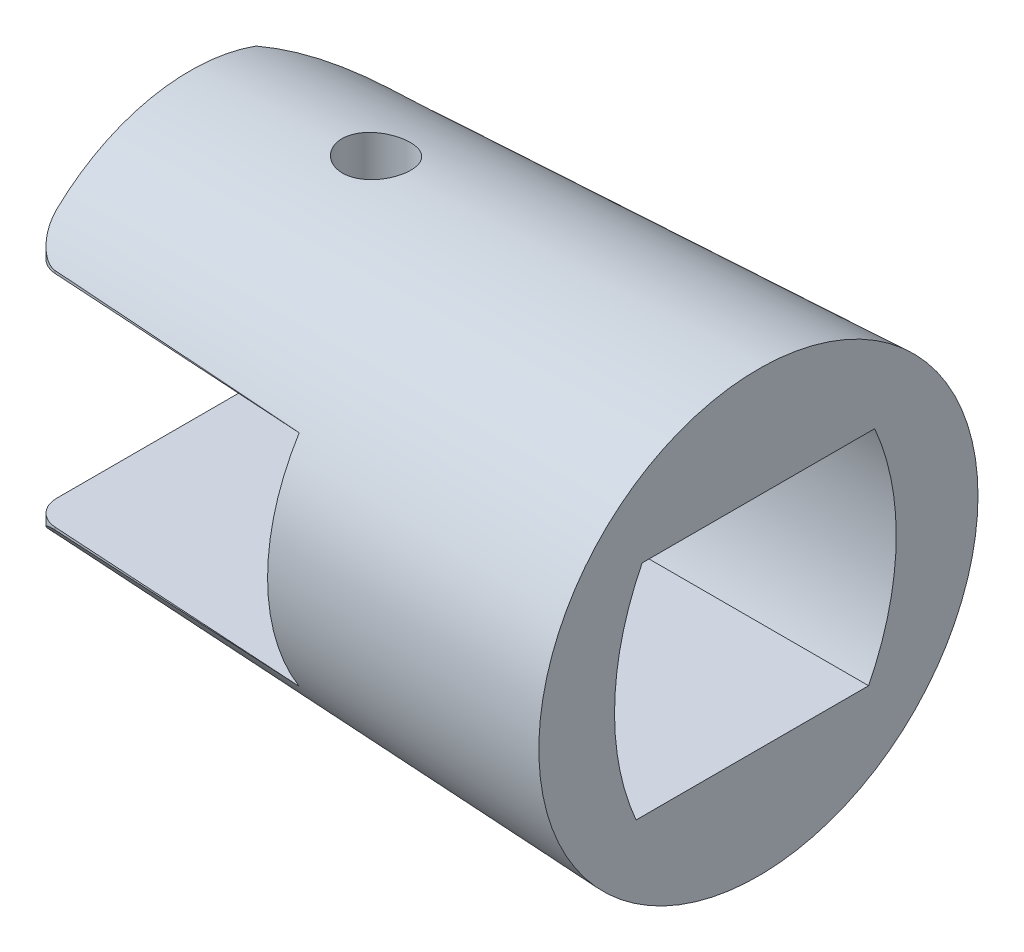
ISO-10303-21;
HEADER;
FILE_DESCRIPTION(('STEP AP214'),'2;1');
FILE_NAME('part.step','',(''),(''),'','','');
FILE_SCHEMA(('AUTOMOTIVE_DESIGN { 1 0 10303 214 1 1 1 1 }'));
ENDSEC;
DATA;
#1=APPLICATION_CONTEXT('core data for automotive mechanical design processes');
#2=APPLICATION_PROTOCOL_DEFINITION('international standard','automotive_design',2000,#1);
#3=PRODUCT_CONTEXT('',#1,'mechanical');
#4=PRODUCT('Part','Part','',(#3));
#5=PRODUCT_RELATED_PRODUCT_CATEGORY('part','',(#4));
#6=PRODUCT_DEFINITION_FORMATION('','',#4);
#7=PRODUCT_DEFINITION_CONTEXT('part definition',#1,'design');
#8=PRODUCT_DEFINITION('design','',#6,#7);
#9=PRODUCT_DEFINITION_SHAPE('','',#8);
#10=(LENGTH_UNIT() NAMED_UNIT(*) SI_UNIT(.MILLI.,.METRE.));
#11=(NAMED_UNIT(*) PLANE_ANGLE_UNIT() SI_UNIT($,.RADIAN.));
#12=(NAMED_UNIT(*) SI_UNIT($,.STERADIAN.) SOLID_ANGLE_UNIT());
#13=UNCERTAINTY_MEASURE_WITH_UNIT(LENGTH_MEASURE(1.E-05),#10,'distance_accuracy_value','');
#14=(GEOMETRIC_REPRESENTATION_CONTEXT(3) GLOBAL_UNCERTAINTY_ASSIGNED_CONTEXT((#13)) GLOBAL_UNIT_ASSIGNED_CONTEXT((#10,
#11,#12)) REPRESENTATION_CONTEXT('',''));
#15=CARTESIAN_POINT('',(0.,0.,0.));
#16=DIRECTION('',(0.,0.,1.));
#17=DIRECTION('',(1.,0.,0.));
#18=AXIS2_PLACEMENT_3D('',#15,#16,#17);
#19=CARTESIAN_POINT('',(-11.605,0.,10.55));
#20=DIRECTION('',(1.,0.,0.));
#21=DIRECTION('',(0.,0.,-1.));
#22=AXIS2_PLACEMENT_3D('',#19,#20,#21);
#23=PLANE('',#22);
#24=DIRECTION('',(0.,0.,-1.));
#25=VECTOR('',#24,1.);
#26=CARTESIAN_POINT('',(-11.605,4.48375,10.55));
#27=LINE('',#26,#25);
#28=CARTESIAN_POINT('',(-11.605,4.48375,7.15049550293544));
#29=VERTEX_POINT('',#28);
#30=CARTESIAN_POINT('',(-11.605,4.48375,4.7475));
#31=VERTEX_POINT('',#30);
#32=EDGE_CURVE('E367',#29,#31,#27,.T.);
#33=ORIENTED_EDGE('',*,*,#32,.T.);
#34=CARTESIAN_POINT('',(-11.605,-0.263749999999944,-4.67395125498193));
#35=DIRECTION('',(1.,0.,0.));
#36=DIRECTION('',(0.,0.,-1.));
#37=AXIS2_PLACEMENT_3D('',#34,#35,#36);
#38=CIRCLE('',#37,10.55);
#39=CARTESIAN_POINT('',(-11.605,-4.48375,4.99528346137487));
#40=VERTEX_POINT('',#39);
#41=EDGE_CURVE('E326',#31,#40,#38,.T.);
#42=ORIENTED_EDGE('',*,*,#41,.T.);
#43=DIRECTION('',(0.,0.,-1.));
#44=VECTOR('',#43,1.);
#45=CARTESIAN_POINT('',(-11.605,-4.48375,10.55));
#46=LINE('',#45,#44);
#47=CARTESIAN_POINT('',(-11.605,-4.48375,7.15049550293544));
#48=VERTEX_POINT('',#47);
#49=EDGE_CURVE('E357',#48,#40,#46,.T.);
#50=ORIENTED_EDGE('',*,*,#49,.F.);
#51=CARTESIAN_POINT('',(-11.605,0.,0.));
#52=DIRECTION('',(1.,0.,0.));
#53=DIRECTION('',(0.,0.,-1.));
#54=AXIS2_PLACEMENT_3D('',#51,#52,#53);
#55=CIRCLE('',#54,8.44);
#56=EDGE_CURVE('E388',#48,#29,#55,.F.);
#57=ORIENTED_EDGE('',*,*,#56,.T.);
#58=EDGE_LOOP('',(#33,#42,#50,#57));
#59=FACE_BOUND('',#58,.T.);
#60=ADVANCED_FACE('F40',(#59),#23,.F.);
#61=CARTESIAN_POINT('',(-23.21,0.,0.));
#62=DIRECTION('',(1.,0.,0.));
#63=DIRECTION('',(0.,0.,-1.));
#64=AXIS2_PLACEMENT_3D('',#61,#62,#63);
#65=CONICAL_SURFACE('',#64,7.9125,0.0454232794215771);
#66=CARTESIAN_POINT('',(-17.090061584297,8.06244968052696,-1.44365090639918));
#67=CARTESIAN_POINT('',(-17.0391950839315,8.05536890361918,-1.49631342004983));
#68=CARTESIAN_POINT('',(-16.9838795616654,8.04871766851789,-1.54478827208686));
#69=CARTESIAN_POINT('',(-16.865822592373,8.03697170659555,-1.63196822159279));
#70=CARTESIAN_POINT('',(-16.8030755126886,8.03187817102355,-1.6706658380195));
#71=CARTESIAN_POINT('',(-16.6718615777768,8.02386708435654,-1.7371393433158));
#72=CARTESIAN_POINT('',(-16.603391960668,8.02095059079489,-1.76490992110652));
#73=CARTESIAN_POINT('',(-16.4627363379627,8.01775700133665,-1.80864448935035));
#74=CARTESIAN_POINT('',(-16.3905513053747,8.0174792179041,-1.82461155429843));
#75=CARTESIAN_POINT('',(-16.2455750319465,8.01977130332117,-1.84414226775304));
#76=CARTESIAN_POINT('',(-16.172805567766,8.02230229595173,-1.84787249025443));
#77=CARTESIAN_POINT('',(-16.0277918352311,8.03010799621155,-1.84333995604715));
#78=CARTESIAN_POINT('',(-15.9555475755798,8.03538274920349,-1.83507700105088));
#79=CARTESIAN_POINT('',(-15.8137243745963,8.0483705968833,-1.80690768221976));
#80=CARTESIAN_POINT('',(-15.7441413151917,8.05607973785967,-1.78702015369926));
#81=CARTESIAN_POINT('',(-15.609361414558,8.07343640339939,-1.73626691935808));
#82=CARTESIAN_POINT('',(-15.5441650958389,8.08308415832973,-1.70539990850104));
#83=CARTESIAN_POINT('',(-15.4184203239987,8.10389932181413,-1.63278080144759));
#84=CARTESIAN_POINT('',(-15.3580083308031,8.11509587724159,-1.5908008258929));
#85=CARTESIAN_POINT('',(-15.2450410975432,8.1380566844217,-1.49746559227806));
#86=CARTESIAN_POINT('',(-15.1924869889327,8.14982101760646,-1.44610898644064));
#87=CARTESIAN_POINT('',(-15.0955334313863,8.17337144218125,-1.33413455904651));
#88=CARTESIAN_POINT('',(-15.0513396899946,8.18515227708955,-1.27333726675774));
#89=CARTESIAN_POINT('',(-14.9738349312624,8.20764846068372,-1.14497884080012));
#90=CARTESIAN_POINT('',(-14.9405238496243,8.2183638156645,-1.07741774709674));
#91=CARTESIAN_POINT('',(-14.8859011115601,8.23798217813389,-0.937605894299068));
#92=CARTESIAN_POINT('',(-14.8645514782155,8.24689086355278,-0.865370799137633));
#93=CARTESIAN_POINT('',(-14.834431984788,8.26239221075432,-0.7180842956494));
#94=CARTESIAN_POINT('',(-14.8256602253587,8.26898522210629,-0.643033314297801));
#95=CARTESIAN_POINT('',(-14.8211171714635,8.27941333252487,-0.494061294406316));
#96=CARTESIAN_POINT('',(-14.8250557386505,8.2833075506593,-0.420153197564171));
#97=CARTESIAN_POINT('',(-14.8452522748912,8.28851237442422,-0.273949539891195));
#98=CARTESIAN_POINT('',(-14.8615091431635,8.2898232108718,-0.201653835568829));
#99=CARTESIAN_POINT('',(-14.9055600064415,8.29003474857885,-0.0618290598224387));
#100=CARTESIAN_POINT('',(-14.9331825616238,8.28897026606659,0.00575409040974519));
#101=CARTESIAN_POINT('',(-14.9991525158925,8.28486799139735,0.135398354822691));
#102=CARTESIAN_POINT('',(-15.0375002811429,8.28183013186363,0.197459280376613));
#103=CARTESIAN_POINT('',(-15.1241101095411,8.2742664828836,0.314739684804201));
#104=CARTESIAN_POINT('',(-15.1724341304377,8.26973128328122,0.369912774031273));
#105=CARTESIAN_POINT('',(-15.2774966291372,8.25978089398286,0.471468888493455));
#106=CARTESIAN_POINT('',(-15.3342357879902,8.25436563305877,0.517851201584875));
#107=CARTESIAN_POINT('',(-15.4554262534295,8.243196822317,0.601165590390375));
#108=CARTESIAN_POINT('',(-15.5199740666102,8.23743960830094,0.637956872780088));
#109=CARTESIAN_POINT('',(-15.6543478876549,8.22625240435274,0.700208236634238));
#110=CARTESIAN_POINT('',(-15.7241739985486,8.2208224208117,0.725668096848127));
#111=CARTESIAN_POINT('',(-15.8674364643777,8.21075352232314,0.764599439664781));
#112=CARTESIAN_POINT('',(-15.9408855157569,8.20611768800928,0.77802505493559));
#113=CARTESIAN_POINT('',(-16.0890573053228,8.19798485215098,0.792306983920096));
#114=CARTESIAN_POINT('',(-16.1637799948208,8.19448780717505,0.793163777042276));
#115=CARTESIAN_POINT('',(-16.3119142697565,8.18876906773056,0.782287772992618));
#116=CARTESIAN_POINT('',(-16.3853309544337,8.18654007015254,0.770628208258206));
#117=CARTESIAN_POINT('',(-16.5291915932126,8.18323643687256,0.735150095660102));
#118=CARTESIAN_POINT('',(-16.5996355775947,8.18216178940946,0.711331671681054));
#119=CARTESIAN_POINT('',(-16.7353437862722,8.18089094472406,0.652293084031937));
#120=CARTESIAN_POINT('',(-16.8006219053703,8.18069230651902,0.61710489641572));
#121=CARTESIAN_POINT('',(-16.924370992221,8.18074886855009,0.536302387873961));
#122=CARTESIAN_POINT('',(-16.9828418061505,8.18100407903961,0.490687831415277));
#123=CARTESIAN_POINT('',(-17.0914759198488,8.1814698119671,0.390180731978183));
#124=CARTESIAN_POINT('',(-17.1416160905405,8.181680210431,0.335263185628587));
#125=CARTESIAN_POINT('',(-17.2319718350664,8.18154030361793,0.217794143980235));
#126=CARTESIAN_POINT('',(-17.2721874796729,8.18119000233947,0.155242703123882));
#127=CARTESIAN_POINT('',(-17.3415450797124,8.17947340873354,0.0242985018576178));
#128=CARTESIAN_POINT('',(-17.3706886995955,8.17810726920777,-0.0440933786680681));
#129=CARTESIAN_POINT('',(-17.4170833667232,8.17402904603581,-0.184757030857067));
#130=CARTESIAN_POINT('',(-17.4343351491093,8.17131704560722,-0.257028562386482));
#131=CARTESIAN_POINT('',(-17.4564373238107,8.16440654332043,-0.403092907423494));
#132=CARTESIAN_POINT('',(-17.4613341895367,8.16021367986514,-0.476878964340625));
#133=CARTESIAN_POINT('',(-17.4587641015088,8.15038936332297,-0.624152041251175));
#134=CARTESIAN_POINT('',(-17.4512947668134,8.14475763337874,-0.697639000926559));
#135=CARTESIAN_POINT('',(-17.4242151938995,8.13229606964064,-0.842436668750986));
#136=CARTESIAN_POINT('',(-17.4045719183252,8.12546301197827,-0.913740899041615));
#137=CARTESIAN_POINT('',(-17.3537094861489,8.11105675397165,-1.05196664326222));
#138=CARTESIAN_POINT('',(-17.3224994530332,8.10348414042314,-1.11889156263164));
#139=CARTESIAN_POINT('',(-17.2588739592688,8.09017176041285,-1.23003437395867));
#140=CARTESIAN_POINT('',(-17.2288576131444,8.08446446067543,-1.27564859553612));
#141=CARTESIAN_POINT('',(-17.1634050114679,8.07324181568923,-1.36283409474292));
#142=CARTESIAN_POINT('',(-17.1279687120811,8.06772647199337,-1.40440533966966));
#143=CARTESIAN_POINT('',(-17.090061584297,8.06244968052696,-1.44365090639918));
#144=B_SPLINE_CURVE_WITH_KNOTS('',3,(#66,#67,#68,#69,#70,#71,#72,#73,#74,#75,#76,#77,#78,#79,
#80,#81,#82,#83,#84,#85,#86,#87,#88,#89,#90,#91,#92,#93,#94,#95,#96,#97,#98,#99,#100,#101,#102,
#103,#104,#105,#106,#107,#108,#109,#110,#111,#112,#113,#114,#115,#116,#117,#118,#119,#120,#121,
#122,#123,#124,#125,#126,#127,#128,#129,#130,#131,#132,#133,#134,#135,#136,#137,#138,#139,#140,
#141,#142,#143),.UNSPECIFIED.,.T.,.F.,(4,2,2,2,2,2,2,2,2,2,2,2,2,2,2,2,2,2,2,2,2,2,2,2,2,2,2,2,
2,2,2,2,2,2,2,2,2,2,4),(0.,0.220482507838196,0.441133210207886,0.661891027595518,
0.882591323278717,1.10027458985518,1.31796145550993,1.53529657673267,1.75265753934349,
1.97487689603475,2.19712821925477,2.42428751242817,2.65144546345816,2.87787805350325,
3.10427644705112,3.32554372075132,3.54679122401552,3.76481712588408,3.98285047217313,
4.20228101273934,4.42172932185544,4.64423763582172,4.8667502941612,5.09010747508465,
5.31345613654586,5.53550508557213,5.75755177222283,5.9789793375714,6.20041190549433,
6.42244933819163,6.64448518748416,6.86648764505381,7.08847637742361,7.30962883876479,
7.53082388491733,7.75262184950044,7.97424523803577,8.13855359305015,8.30286327700211),.UNSPECIFIED.);
#145=CARTESIAN_POINT('',(-17.090061584297,8.06244968052696,-1.44365090639918));
#146=VERTEX_POINT('',#145);
#147=EDGE_CURVE('E177',#146,#146,#144,.T.);
#148=ORIENTED_EDGE('',*,*,#147,.T.);
#149=EDGE_LOOP('',(#148));
#150=FACE_BOUND('',#149,.T.);
#151=CARTESIAN_POINT('',(-43.7950049672609,0.,5.17962979047349));
#152=DIRECTION('',(-0.0611115794993297,0.,0.998130940734279));
#153=DIRECTION('',(0.998130940734279,0.,0.0611115794993297));
#154=AXIS2_PLACEMENT_3D('',#151,#152,#153);
#155=ELLIPSE('',#154,114.165236984435,4.67412280810782);
#156=CARTESIAN_POINT('',(-22.2194727163718,-4.58957622991047,6.50061364197156));
#157=VERTEX_POINT('',#156);
#158=EDGE_CURVE('E232',#48,#157,#155,.F.);
#159=ORIENTED_EDGE('',*,*,#158,.T.);
#160=CARTESIAN_POINT('',(-22.2194727163718,-4.58957622991047,6.50061364197156));
#161=CARTESIAN_POINT('',(-22.2378955833266,-4.58971751646675,6.49948828130333));
#162=CARTESIAN_POINT('',(-22.2562728617724,-4.59055490650645,6.49787495469926));
#163=CARTESIAN_POINT('',(-22.2927895877851,-4.59357220610426,6.49370944531139));
#164=CARTESIAN_POINT('',(-22.3109292740763,-4.59575064232442,6.49115829410431));
#165=CARTESIAN_POINT('',(-22.3644341606625,-4.60416326433143,6.48221491154728));
#166=CARTESIAN_POINT('',(-22.3992992463734,-4.61228037479458,6.47450600931027));
#167=CARTESIAN_POINT('',(-22.4752248800499,-4.6353569257684,6.45376346309217));
#168=CARTESIAN_POINT('',(-22.5156795379547,-4.65151352699146,6.43988367936869));
#169=CARTESIAN_POINT('',(-22.592749259187,-4.68887763787481,6.40839037225423));
#170=CARTESIAN_POINT('',(-22.6293457998408,-4.71010804509916,6.3907599634886));
#171=CARTESIAN_POINT('',(-22.7162026174104,-4.76787351953507,6.34292919994423));
#172=CARTESIAN_POINT('',(-22.7639174015495,-4.80669321181365,6.31090275314476));
#173=CARTESIAN_POINT('',(-22.8511589175049,-4.88910596393184,6.24224165540526));
#174=CARTESIAN_POINT('',(-22.8906682844572,-4.93270885440554,6.20559749005677));
#175=CARTESIAN_POINT('',(-22.9537952766369,-5.01200312750901,6.13791069418124));
#176=CARTESIAN_POINT('',(-22.9789586259541,-5.04711406516765,6.10760461531965));
#177=CARTESIAN_POINT('',(-23.0252668253422,-5.11841159402779,6.04522298283795));
#178=CARTESIAN_POINT('',(-23.0464095477783,-5.15459874309127,6.01314650387708));
#179=CARTESIAN_POINT('',(-23.1040632795921,-5.26412143616539,5.91460105569731));
#180=CARTESIAN_POINT('',(-23.1348289351378,-5.33845627464331,5.8457839317415));
#181=CARTESIAN_POINT('',(-23.1751279180864,-5.46764016549298,5.72218736546366));
#182=CARTESIAN_POINT('',(-23.1881159448036,-5.52247763347008,5.66847001256534));
#183=CARTESIAN_POINT('',(-23.205510945274,-5.63128945133458,5.55926561121194));
#184=CARTESIAN_POINT('',(-23.209952723208,-5.68526641037244,5.50378667983953));
#185=CARTESIAN_POINT('',(-23.2099999999995,-5.73859563074619,5.44758445889379));
#186=B_SPLINE_CURVE_WITH_KNOTS('',3,(#160,#161,#162,#163,#164,#165,#166,#167,#168,#169,#170,
#171,#172,#173,#174,#175,#176,#177,#178,#179,#180,#181,#182,#183,#184,#185),.UNSPECIFIED.,.F.,
.F.,(4,2,2,2,2,2,2,2,2,2,2,2,4),(0.,0.0553352579086653,0.110609830066673,0.219931872805138,
0.356346290671421,0.493388361199761,0.700294302720145,0.907633748521922,1.06573084468625,
1.2239113712536,1.54010137872261,1.77321926770485,2.00538576920458),.UNSPECIFIED.);
#187=CARTESIAN_POINT('',(-23.21,-5.73859617882694,5.44758497921158));
#188=VERTEX_POINT('',#187);
#189=EDGE_CURVE('E337',#157,#188,#186,.T.);
#190=ORIENTED_EDGE('',*,*,#189,.T.);
#191=CARTESIAN_POINT('',(-23.21,0.,0.));
#192=DIRECTION('',(1.,0.,0.));
#193=DIRECTION('',(0.,0.,-1.));
#194=AXIS2_PLACEMENT_3D('',#191,#192,#193);
#195=CIRCLE('',#194,7.9125);
#196=CARTESIAN_POINT('',(-23.2099999999998,-7.44012375273857,-2.69299364907075));
#197=VERTEX_POINT('',#196);
#198=EDGE_CURVE('E260',#188,#197,#195,.T.);
#199=ORIENTED_EDGE('',*,*,#198,.T.);
#200=CARTESIAN_POINT('',(-17.4362200153947,-4.13450643292635,-7.05234534505413));
#201=CARTESIAN_POINT('',(-17.5580619692967,-4.17072806740062,-7.02469593112042));
#202=CARTESIAN_POINT('',(-17.6782861288292,-4.21034858936513,-6.99469382121139));
#203=CARTESIAN_POINT('',(-17.9154161362306,-4.29516648521822,-6.93025180709035));
#204=CARTESIAN_POINT('',(-18.0323248765548,-4.34035880173552,-6.89581592605553));
#205=CARTESIAN_POINT('',(-18.2626125962375,-4.43502576042012,-6.82283363154321));
#206=CARTESIAN_POINT('',(-18.3760011681346,-4.48448705954247,-6.78429994428317));
#207=CARTESIAN_POINT('',(-18.599760604753,-4.58685350549427,-6.70319479264512));
#208=CARTESIAN_POINT('',(-18.7101306984464,-4.63975952077378,-6.66062230879689));
#209=CARTESIAN_POINT('',(-19.0372264752587,-4.80252088871705,-6.52691000897547));
#210=CARTESIAN_POINT('',(-19.2496241791359,-4.91628561055324,-6.42987564138847));
#211=CARTESIAN_POINT('',(-19.6639490837256,-5.14908316642906,-6.22059522871289));
#212=CARTESIAN_POINT('',(-19.8658668726962,-5.26812056382995,-6.10833582642197));
#213=CARTESIAN_POINT('',(-20.2573796581832,-5.50624331160548,-5.87016032019416));
#214=CARTESIAN_POINT('',(-20.4470907103209,-5.62531198432421,-5.74441833918706));
#215=CARTESIAN_POINT('',(-20.8167752561244,-5.86192876457168,-5.47817744218058));
#216=CARTESIAN_POINT('',(-20.9967511810422,-5.97947724612098,-5.33768223667486));
#217=CARTESIAN_POINT('',(-21.3462917752689,-6.21030790734553,-5.04207517373281));
#218=CARTESIAN_POINT('',(-21.5158806679806,-6.32359975490446,-4.88699964318125));
#219=CARTESIAN_POINT('',(-21.8443655120496,-6.54385319028414,-4.56183605098462));
#220=CARTESIAN_POINT('',(-22.003263512009,-6.65081599040849,-4.39175088002776));
#221=CARTESIAN_POINT('',(-22.3532304107545,-6.88553734042681,-3.98551605761833));
#222=CARTESIAN_POINT('',(-22.5404962546578,-7.01048972963838,-3.74438782121649));
#223=CARTESIAN_POINT('',(-22.892995367743,-7.24125815755689,-3.23698355246613));
#224=CARTESIAN_POINT('',(-23.0581631283577,-7.34701761632605,-2.97063657913536));
#225=CARTESIAN_POINT('',(-23.210325005819,-7.44032311703849,-2.69239937262026));
#226=B_SPLINE_CURVE_WITH_KNOTS('',3,(#200,#201,#202,#203,#204,#205,#206,#207,#208,#209,#210,
#211,#212,#213,#214,#215,#216,#217,#218,#219,#220,#221,#222,#223,#224,#225),.UNSPECIFIED.,.F.,
.F.,(4,2,2,2,2,2,2,2,2,2,2,2,4),(0.,0.390078042201714,0.779804592062204,1.16835431750729,
1.55700238269105,2.33536081490443,3.11440658666015,3.88438671048944,4.65417364302689,
5.42209105947755,6.18986090507121,7.17730065009558,8.16760564443103),.UNSPECIFIED.);
#227=CARTESIAN_POINT('',(-18.3724902715213,-4.48375,-6.78466661651842));
#228=VERTEX_POINT('',#227);
#229=EDGE_CURVE('E228',#228,#197,#226,.T.);
#230=ORIENTED_EDGE('',*,*,#229,.F.);
#231=CARTESIAN_POINT('',(-35.6723829618006,-4.48375,-5.81894440664413));
#232=CARTESIAN_POINT('',(-33.111565252436,-4.48375,-5.96585517968319));
#233=CARTESIAN_POINT('',(-30.5506342919847,-4.48375,-6.1107752019512));
#234=CARTESIAN_POINT('',(-25.4285871564146,-4.48375,-6.39726717738989));
#235=CARTESIAN_POINT('',(-22.8674709814556,-4.48375,-6.53883913341681));
#236=CARTESIAN_POINT('',(-17.7450910024461,-4.48375,-6.81926862077435));
#237=CARTESIAN_POINT('',(-15.1838271984342,-4.48375,-6.95812615281254));
#238=CARTESIAN_POINT('',(-10.0611758726228,-4.48375,-7.23356491497524));
#239=CARTESIAN_POINT('',(-7.49978835075583,-4.48375,-7.37014614384492));
#240=CARTESIAN_POINT('',(-1.4913270404122,-4.48375,-7.68827911589834));
#241=CARTESIAN_POINT('',(1.95578793076879,-4.48375,-7.86905270540611));
#242=CARTESIAN_POINT('',(8.85016494011228,-4.48375,-8.22778056095336));
#243=CARTESIAN_POINT('',(12.2974269782988,-4.48375,-8.40573482653122));
#244=CARTESIAN_POINT('',(19.1920636158929,-4.48375,-8.7593194232352));
#245=CARTESIAN_POINT('',(22.6394382150762,-4.48375,-8.93494975873824));
#246=CARTESIAN_POINT('',(29.5342855080713,-4.48375,-9.28424951142856));
#247=CARTESIAN_POINT('',(32.9817582018461,-4.48375,-9.45791892934309));
#248=CARTESIAN_POINT('',(36.4292707416216,-4.48375,-9.63078929058168));
#249=B_SPLINE_CURVE_WITH_KNOTS('',3,(#231,#232,#233,#234,#235,#236,#237,#238,#239,#240,#241,
#242,#243,#244,#245,#246,#247,#248),.UNSPECIFIED.,.F.,.F.,(4,2,2,2,2,2,2,2,4),(0.,
7.6950827091855,15.3901588534396,23.0852329917703,30.7803113719571,41.1358652091922,
51.4914207419453,61.8469567680608,72.2024889533846),.UNSPECIFIED.);
#250=CARTESIAN_POINT('',(-11.605,-4.48375,-7.15049550293544));
#251=VERTEX_POINT('',#250);
#252=EDGE_CURVE('E311',#228,#251,#249,.T.);
#253=ORIENTED_EDGE('',*,*,#252,.T.);
#254=CARTESIAN_POINT('',(-11.605,4.48375,-7.15049550293544));
#255=VERTEX_POINT('',#254);
#256=EDGE_CURVE('E319',#255,#251,#55,.F.);
#257=ORIENTED_EDGE('',*,*,#256,.F.);
#258=CARTESIAN_POINT('',(-35.6723829618006,4.48375,-5.81894440664414));
#259=CARTESIAN_POINT('',(-33.111565252436,4.48375,-5.96585517968319));
#260=CARTESIAN_POINT('',(-30.5506342919847,4.48375,-6.1107752019512));
#261=CARTESIAN_POINT('',(-25.4285871564146,4.48375,-6.39726717738989));
#262=CARTESIAN_POINT('',(-22.8674709814556,4.48375,-6.53883913341681));
#263=CARTESIAN_POINT('',(-17.7450910024461,4.48375,-6.81926862077435));
#264=CARTESIAN_POINT('',(-15.1838271984342,4.48375,-6.95812615281254));
#265=CARTESIAN_POINT('',(-10.0611758726228,4.48375,-7.23356491497524));
#266=CARTESIAN_POINT('',(-7.49978835075583,4.48375,-7.37014614384492));
#267=CARTESIAN_POINT('',(-1.4913270404122,4.48375,-7.68827911589834));
#268=CARTESIAN_POINT('',(1.95578793076879,4.48375,-7.86905270540611));
#269=CARTESIAN_POINT('',(8.85016494011228,4.48375,-8.22778056095336));
#270=CARTESIAN_POINT('',(12.2974269782988,4.48375,-8.40573482653122));
#271=CARTESIAN_POINT('',(19.1920636158929,4.48375,-8.7593194232352));
#272=CARTESIAN_POINT('',(22.6394382150762,4.48375,-8.93494975873824));
#273=CARTESIAN_POINT('',(29.5342855080713,4.48375,-9.28424951142856));
#274=CARTESIAN_POINT('',(32.9817582018461,4.48375,-9.45791892934309));
#275=CARTESIAN_POINT('',(36.4292707416216,4.48375,-9.63078929058167));
#276=B_SPLINE_CURVE_WITH_KNOTS('',3,(#258,#259,#260,#261,#262,#263,#264,#265,#266,#267,#268,
#269,#270,#271,#272,#273,#274,#275),.UNSPECIFIED.,.F.,.F.,(4,2,2,2,2,2,2,2,4),(0.,
7.6950827091855,15.3901588534396,23.0852329917703,30.7803113719571,41.1358652091922,
51.4914207419453,61.8469567680608,72.2024889533846),.UNSPECIFIED.);
#277=CARTESIAN_POINT('',(-18.3724902715213,4.48375,-6.78466661651842));
#278=VERTEX_POINT('',#277);
#279=EDGE_CURVE('E320',#255,#278,#276,.F.);
#280=ORIENTED_EDGE('',*,*,#279,.T.);
#281=CARTESIAN_POINT('',(-23.210325005819,7.44032311703849,-2.69239937262026));
#282=CARTESIAN_POINT('',(-23.0903104214851,7.36671607888568,-2.91187268513995));
#283=CARTESIAN_POINT('',(-22.9621454423484,7.28533956371306,-3.1240175455307));
#284=CARTESIAN_POINT('',(-22.691460673459,7.10983119257108,-3.53281803412272));
#285=CARTESIAN_POINT('',(-22.5489650103401,7.015720685777,-3.72949873431781));
#286=CARTESIAN_POINT('',(-22.2515266597899,6.81751371506787,-4.106798460334));
#287=CARTESIAN_POINT('',(-22.0966158501074,6.71344270061108,-4.28745626162661));
#288=CARTESIAN_POINT('',(-21.7752568203099,6.49752627469726,-4.63331542935396));
#289=CARTESIAN_POINT('',(-21.6088036372477,6.38567751893677,-4.79851007435699));
#290=CARTESIAN_POINT('',(-21.2665181177488,6.15743522395166,-5.11241383285975));
#291=CARTESIAN_POINT('',(-21.0907569232178,6.04107758760061,-5.26122700166178));
#292=CARTESIAN_POINT('',(-20.7293626868111,5.80555023383236,-5.54383228542638));
#293=CARTESIAN_POINT('',(-20.5437302261586,5.68638068221093,-5.67762528334126));
#294=CARTESIAN_POINT('',(-20.1629352618078,5.44807509153048,-5.93018988644338));
#295=CARTESIAN_POINT('',(-19.9677851214435,5.32893920106508,-6.04898029541557));
#296=CARTESIAN_POINT('',(-19.567388645046,5.09377424799889,-6.27174883891508));
#297=CARTESIAN_POINT('',(-19.3621434047397,4.97774485031991,-6.37572857624756));
#298=CARTESIAN_POINT('',(-19.0180507878756,4.79428858256022,-6.53321396890652));
#299=CARTESIAN_POINT('',(-18.8824493202426,4.72463930031393,-6.59124799137472));
#300=CARTESIAN_POINT('',(-18.6066748259854,4.5897768443338,-6.70105633132345));
#301=CARTESIAN_POINT('',(-18.4665045781819,4.52456104589863,-6.7528343668253));
#302=CARTESIAN_POINT('',(-18.1810697095115,4.40017265662335,-6.84996074928823));
#303=CARTESIAN_POINT('',(-18.0357993400597,4.34100719967819,-6.89530153005285));
#304=CARTESIAN_POINT('',(-17.739961641339,4.23094811250481,-6.9791169168972));
#305=CARTESIAN_POINT('',(-17.5893859080381,4.18006839657278,-7.01757998359132));
#306=CARTESIAN_POINT('',(-17.4362200153946,4.13450643292634,-7.05234534505414));
#307=B_SPLINE_CURVE_WITH_KNOTS('',3,(#281,#282,#283,#284,#285,#286,#287,#288,#289,#290,#291,
#292,#293,#294,#295,#296,#297,#298,#299,#300,#301,#302,#303,#304,#305,#306),.UNSPECIFIED.,.F.,
.F.,(4,2,2,2,2,2,2,2,2,2,2,2,4),(0.,0.781579818536042,1.56186515072213,2.34020750298568,
3.11888662443912,3.89229301690774,4.66565392128434,5.43803569074797,6.21033380974503,
6.69947697870674,7.18832799792654,7.67774892672167,8.16798345172577),.UNSPECIFIED.);
#308=CARTESIAN_POINT('',(-23.2099999999999,7.44012375273862,-2.69299364907062));
#309=VERTEX_POINT('',#308);
#310=EDGE_CURVE('E230',#309,#278,#307,.T.);
#311=ORIENTED_EDGE('',*,*,#310,.F.);
#312=CARTESIAN_POINT('',(-23.21,5.73859583086861,5.44758509705236));
#313=VERTEX_POINT('',#312);
#314=EDGE_CURVE('E45',#309,#313,#195,.T.);
#315=ORIENTED_EDGE('',*,*,#314,.T.);
#316=CARTESIAN_POINT('',(-23.2099999999997,5.73859540692857,5.44758469466777));
#317=CARTESIAN_POINT('',(-23.2099873538658,5.69894458186839,5.48936281166775));
#318=CARTESIAN_POINT('',(-23.2075187094657,5.65892118255522,5.53076567437115));
#319=CARTESIAN_POINT('',(-23.19783621497,5.57841269482605,5.61257411676388));
#320=CARTESIAN_POINT('',(-23.1906214318179,5.53792751716594,5.65297949873484));
#321=CARTESIAN_POINT('',(-23.1715295599718,5.45643609484656,5.73288123803722));
#322=CARTESIAN_POINT('',(-23.1596118142079,5.41542840795518,5.77236639990687));
#323=CARTESIAN_POINT('',(-23.1311853655423,5.3335929550689,5.84981390772213));
#324=CARTESIAN_POINT('',(-23.1146775814024,5.29276515472681,5.8877765566822));
#325=CARTESIAN_POINT('',(-23.065768611532,5.187334397234,5.98420547282239));
#326=CARTESIAN_POINT('',(-23.0297696970264,5.12313535138326,6.04133617184112));
#327=CARTESIAN_POINT('',(-22.9452881940547,4.99841942436214,6.14986037392933));
#328=CARTESIAN_POINT('',(-22.8968504975647,4.93789024987262,6.20127357479615));
#329=CARTESIAN_POINT('',(-22.8086734717229,4.84773632050656,6.27678568961789));
#330=CARTESIAN_POINT('',(-22.7735927796161,4.81566579432979,6.30340118064211));
#331=CARTESIAN_POINT('',(-22.697997266282,4.75544224623267,6.35324890514127));
#332=CARTESIAN_POINT('',(-22.6574873232651,4.72728575327048,6.37648413715886));
#333=CARTESIAN_POINT('',(-22.5805687325099,4.68260839298261,6.41366214276781));
#334=CARTESIAN_POINT('',(-22.5453034009292,4.66489608169112,6.4285181535062));
#335=CARTESIAN_POINT('',(-22.4715822071106,4.63432039945908,6.45472044748387));
#336=CARTESIAN_POINT('',(-22.4331378845867,4.62144035552023,6.4660787741695));
#337=CARTESIAN_POINT('',(-22.365461468463,4.60470120839693,6.4817776559162));
#338=CARTESIAN_POINT('',(-22.3368605193743,4.59930148355197,6.48720006819016));
#339=CARTESIAN_POINT('',(-22.2787154402592,4.5918289485156,6.49572654471105));
#340=CARTESIAN_POINT('',(-22.2491666484586,4.58977647741498,6.49881637491129));
#341=CARTESIAN_POINT('',(-22.2194727163718,4.58957622991032,6.50061364197156));
#342=B_SPLINE_CURVE_WITH_KNOTS('',3,(#316,#317,#318,#319,#320,#321,#322,#323,#324,#325,#326,
#327,#328,#329,#330,#331,#332,#333,#334,#335,#336,#337,#338,#339,#340,#341),.UNSPECIFIED.,.F.,
.F.,(4,2,2,2,2,2,2,2,2,2,2,2,4),(0.,0.172718383218086,0.345470731774578,0.519750443189233,
0.69399529511367,0.972586289630744,1.25018563445361,1.41323319784836,1.57613523220037,
1.70220853453092,1.82784274990186,1.91638565208476,2.00546459416211),.UNSPECIFIED.);
#343=CARTESIAN_POINT('',(-22.2194727163718,4.58957622991047,6.50061364197156));
#344=VERTEX_POINT('',#343);
#345=EDGE_CURVE('E334',#313,#344,#342,.T.);
#346=ORIENTED_EDGE('',*,*,#345,.T.);
#347=EDGE_CURVE('E246',#344,#29,#155,.F.);
#348=ORIENTED_EDGE('',*,*,#347,.T.);
#349=ORIENTED_EDGE('',*,*,#56,.F.);
#350=EDGE_LOOP('',(#159,#190,#199,#230,#253,#257,#280,#311,#315,#346,#348,#349));
#351=FACE_BOUND('',#350,.T.);
#352=CARTESIAN_POINT('',(0.,0.,0.));
#353=DIRECTION('',(1.,0.,0.));
#354=DIRECTION('',(0.,0.,-1.));
#355=AXIS2_PLACEMENT_3D('',#352,#353,#354);
#356=CIRCLE('',#355,8.9675);
#357=CARTESIAN_POINT('',(0.,0.,-8.9675));
#358=VERTEX_POINT('',#357);
#359=EDGE_CURVE('E352',#358,#358,#356,.T.);
#360=ORIENTED_EDGE('',*,*,#359,.F.);
#361=EDGE_LOOP('',(#360));
#362=FACE_BOUND('',#361,.T.);
#363=CARTESIAN_POINT('',(-17.090061584297,-8.06244968052696,-1.44365090639918));
#364=CARTESIAN_POINT('',(-17.14176489377,-8.06964770596378,-1.39011443501709));
#365=CARTESIAN_POINT('',(-17.1889278417469,-8.07729723490906,-1.3321910861665));
#366=CARTESIAN_POINT('',(-17.2728452828456,-8.09276637002792,-1.20919847877353));
#367=CARTESIAN_POINT('',(-17.3095887136042,-8.1005861475429,-1.14412172641679));
#368=CARTESIAN_POINT('',(-17.3715906850538,-8.1157243773093,-1.00866779056817));
#369=CARTESIAN_POINT('',(-17.3968522737935,-8.12304296217211,-0.938292019579795));
#370=CARTESIAN_POINT('',(-17.4351467925524,-8.13664400672366,-0.79421075541845));
#371=CARTESIAN_POINT('',(-17.4481830485627,-8.14292674783768,-0.720506173595679));
#372=CARTESIAN_POINT('',(-17.4615886704404,-8.15408060636823,-0.572142048155975));
#373=CARTESIAN_POINT('',(-17.4620079751382,-8.15895721338061,-0.497487439835047));
#374=CARTESIAN_POINT('',(-17.4502441178415,-8.16718768389819,-0.349090676518321));
#375=CARTESIAN_POINT('',(-17.4380610722622,-8.1705415614693,-0.275348513100114));
#376=CARTESIAN_POINT('',(-17.4015754689509,-8.17577468639688,-0.131564867384044));
#377=CARTESIAN_POINT('',(-17.3773802959982,-8.17766662662733,-0.0614965706930328));
#378=CARTESIAN_POINT('',(-17.3175998534816,-8.18028432667876,0.0736226215959224));
#379=CARTESIAN_POINT('',(-17.2820145674432,-8.18101008481296,0.138673509936568));
#380=CARTESIAN_POINT('',(-17.2004745955188,-8.18170192446806,0.261886063709696));
#381=CARTESIAN_POINT('',(-17.1545233151367,-8.18166825512224,0.320049982146417));
#382=CARTESIAN_POINT('',(-17.0535407432934,-8.18133552264133,0.427873926660399));
#383=CARTESIAN_POINT('',(-16.9985092744804,-8.18103645432205,0.477533786599879));
#384=CARTESIAN_POINT('',(-16.8807036657566,-8.1806845510024,0.567111556745182));
#385=CARTESIAN_POINT('',(-16.8179025097815,-8.18063260143841,0.606993950727929));
#386=CARTESIAN_POINT('',(-16.6864997194386,-8.18124230348621,0.675650770879944));
#387=CARTESIAN_POINT('',(-16.6178981762645,-8.18190394388084,0.704425371646458));
#388=CARTESIAN_POINT('',(-16.4769319904997,-8.18428481871389,0.75002437622692));
#389=CARTESIAN_POINT('',(-16.404571551971,-8.18600289396519,0.766861834690169));
#390=CARTESIAN_POINT('',(-16.2580921375839,-8.19066800956374,0.788169148428271));
#391=CARTESIAN_POINT('',(-16.1839731909584,-8.19361502949479,0.7926392091508));
#392=CARTESIAN_POINT('',(-16.0362486511818,-8.20070102641619,0.789113561934668));
#393=CARTESIAN_POINT('',(-15.962642305425,-8.20483747876647,0.781144100594636));
#394=CARTESIAN_POINT('',(-15.8178513456299,-8.21407292290299,0.75304372946282));
#395=CARTESIAN_POINT('',(-15.7466668201591,-8.21917194984655,0.732912375407814));
#396=CARTESIAN_POINT('',(-15.6083944126834,-8.22994551925997,0.680961051078074));
#397=CARTESIAN_POINT('',(-15.5413254774752,-8.23562244386223,0.649091155233411));
#398=CARTESIAN_POINT('',(-15.4134711917001,-8.24698196613011,0.574566818667802));
#399=CARTESIAN_POINT('',(-15.3526861247283,-8.2526645640401,0.531911891510582));
#400=CARTESIAN_POINT('',(-15.2388143635547,-8.26343086039142,0.436756998097683));
#401=CARTESIAN_POINT('',(-15.185766104628,-8.26851154667109,0.384210664331508));
#402=CARTESIAN_POINT('',(-15.0892384196748,-8.27738925581584,0.27086548006839));
#403=CARTESIAN_POINT('',(-15.0457585776792,-8.28118633448723,0.210066988504511));
#404=CARTESIAN_POINT('',(-14.9699055108159,-8.28688460548587,0.0823729448376945));
#405=CARTESIAN_POINT('',(-14.9374588724326,-8.28879849655436,0.015521597590089));
#406=CARTESIAN_POINT('',(-14.8842334344157,-8.29032361938926,-0.122697410355429));
#407=CARTESIAN_POINT('',(-14.8634533787217,-8.28993509909245,-0.194064583944596));
#408=CARTESIAN_POINT('',(-14.8343699411654,-8.28662121398021,-0.338184171574642));
#409=CARTESIAN_POINT('',(-14.8258940305888,-8.28373185425525,-0.410902653777151));
#410=CARTESIAN_POINT('',(-14.8210578822275,-8.27543968125128,-0.556594591582654));
#411=CARTESIAN_POINT('',(-14.8246973704745,-8.27003692481064,-0.629568041382732));
#412=CARTESIAN_POINT('',(-14.8438810277758,-8.25693443371188,-0.773578411465194));
#413=CARTESIAN_POINT('',(-14.8594036188405,-8.24923887789853,-0.8446186004067));
#414=CARTESIAN_POINT('',(-14.9017934039312,-8.23195738259718,-0.982984787089515));
#415=CARTESIAN_POINT('',(-14.92866173554,-8.22237125360189,-1.05031041162378));
#416=CARTESIAN_POINT('',(-14.9935308783799,-8.20169410256095,-1.1806983067908));
#417=CARTESIAN_POINT('',(-15.031727844227,-8.19057858900478,-1.24365906299623));
#418=CARTESIAN_POINT('',(-15.1179782014566,-8.16770996403612,-1.36229649889326));
#419=CARTESIAN_POINT('',(-15.1660330185395,-8.15595676057821,-1.41797212305645));
#420=CARTESIAN_POINT('',(-15.2718255819573,-8.13236384181978,-1.52166623623845));
#421=CARTESIAN_POINT('',(-15.3297437341263,-8.12052740106146,-1.56950164008507));
#422=CARTESIAN_POINT('',(-15.4529899097654,-8.09787107662386,-1.65473949697834));
#423=CARTESIAN_POINT('',(-15.5183179915443,-8.08705120094517,-1.69214186791922));
#424=CARTESIAN_POINT('',(-15.654466189011,-8.06724307727047,-1.75531024558722));
#425=CARTESIAN_POINT('',(-15.7252739730994,-8.05825087276712,-1.7811015381507));
#426=CARTESIAN_POINT('',(-15.8704942758422,-8.04272162602478,-1.82029174872493));
#427=CARTESIAN_POINT('',(-15.944906051222,-8.03618407995937,-1.83369321061435));
#428=CARTESIAN_POINT('',(-16.0932414061729,-8.02612136606278,-1.84741740977157));
#429=CARTESIAN_POINT('',(-16.167130738335,-8.02252502050239,-1.84805852780534));
#430=CARTESIAN_POINT('',(-16.3140745941616,-8.01821601569806,-1.83698346728277));
#431=CARTESIAN_POINT('',(-16.3871290534619,-8.01750357731222,-1.82526634238237));
#432=CARTESIAN_POINT('',(-16.528952352885,-8.01881614984133,-1.7901273318062));
#433=CARTESIAN_POINT('',(-16.5977741715442,-8.02079291464769,-1.7669163647871));
#434=CARTESIAN_POINT('',(-16.7305503521132,-8.0270353019071,-1.70959202901778));
#435=CARTESIAN_POINT('',(-16.7945089222206,-8.0312989191958,-1.67548822193848));
#436=CARTESIAN_POINT('',(-16.8979153998383,-8.040051314538,-1.60894641509801));
#437=CARTESIAN_POINT('',(-16.9390236033874,-8.04410172735172,-1.57899095727316));
#438=CARTESIAN_POINT('',(-17.0174780884823,-8.05284807316598,-1.51458657064106));
#439=CARTESIAN_POINT('',(-17.0548242931616,-8.05754401935165,-1.48013755005271));
#440=CARTESIAN_POINT('',(-17.090061584297,-8.06244968052696,-1.44365090639918));
#441=B_SPLINE_CURVE_WITH_KNOTS('',3,(#363,#364,#365,#366,#367,#368,#369,#370,#371,#372,#373,
#374,#375,#376,#377,#378,#379,#380,#381,#382,#383,#384,#385,#386,#387,#388,#389,#390,#391,#392,
#393,#394,#395,#396,#397,#398,#399,#400,#401,#402,#403,#404,#405,#406,#407,#408,#409,#410,#411,
#412,#413,#414,#415,#416,#417,#418,#419,#420,#421,#422,#423,#424,#425,#426,#427,#428,#429,#430,
#431,#432,#433,#434,#435,#436,#437,#438,#439,#440),.UNSPECIFIED.,.T.,.F.,(4,2,2,2,2,2,2,2,2,2,2,
2,2,2,2,2,2,2,2,2,2,2,2,2,2,2,2,2,2,2,2,2,2,2,2,2,2,2,4),(0.,0.224137843911271,
0.448512770745386,0.672828098625,0.897082382159454,1.12044893333288,1.34381342116005,
1.5652161115372,1.78661912215043,2.00794950166018,2.229284204652,2.45141136440557,
2.67353503252319,2.89541540636438,3.11729209429833,3.33870126900096,3.56011853207467,
3.78248859598377,4.00486869121904,4.2283184286098,4.45175845001907,4.67368122477675,
4.89558010205865,5.11433641470196,5.33308778059379,5.55144286522182,5.76981984846368,
5.99222387182116,6.21466008326132,6.44171692856905,6.6687755607159,6.89533729893172,
7.12185250917886,7.34270869878035,7.56358180187993,7.78054411095998,7.99731649279522,
8.15006975369581,8.30282613507359),.UNSPECIFIED.);
#442=CARTESIAN_POINT('',(-17.090061584297,-8.06244968052696,-1.44365090639918));
#443=VERTEX_POINT('',#442);
#444=EDGE_CURVE('E184',#443,#443,#441,.T.);
#445=ORIENTED_EDGE('',*,*,#444,.T.);
#446=EDGE_LOOP('',(#445));
#447=FACE_BOUND('',#446,.T.);
#448=ADVANCED_FACE('F188',(#150,#351,#362,#447),#65,.T.);
#449=CARTESIAN_POINT('',(-23.21,0.,0.));
#450=DIRECTION('',(1.,0.,0.));
#451=DIRECTION('',(0.,0.,-1.));
#452=AXIS2_PLACEMENT_3D('',#449,#450,#451);
#453=PLANE('',#452);
#454=ORIENTED_EDGE('',*,*,#198,.F.);
#455=DIRECTION('',(0.,-1.,0.));
#456=VECTOR('',#455,1.);
#457=CARTESIAN_POINT('',(-23.21,-4.48375,5.4475854994969));
#458=LINE('',#457,#456);
#459=CARTESIAN_POINT('',(-23.21,-4.48375,5.4475854994969));
#460=VERTEX_POINT('',#459);
#461=EDGE_CURVE('E340',#188,#460,#458,.F.);
#462=ORIENTED_EDGE('',*,*,#461,.T.);
#463=DIRECTION('',(0.,0.,1.));
#464=VECTOR('',#463,1.);
#465=CARTESIAN_POINT('',(-23.21,-4.48375,0.));
#466=LINE('',#465,#464);
#467=CARTESIAN_POINT('',(-23.21,-4.48375,-2.69299364907036));
#468=VERTEX_POINT('',#467);
#469=EDGE_CURVE('E284',#468,#460,#466,.T.);
#470=ORIENTED_EDGE('',*,*,#469,.F.);
#471=DIRECTION('',(0.,-1.,0.));
#472=VECTOR('',#471,1.);
#473=CARTESIAN_POINT('',(-23.21,10.55,-2.69299364907036));
#474=LINE('',#473,#472);
#475=EDGE_CURVE('E372',#468,#197,#474,.T.);
#476=ORIENTED_EDGE('',*,*,#475,.T.);
#477=EDGE_LOOP('',(#454,#462,#470,#476));
#478=FACE_BOUND('',#477,.T.);
#479=ADVANCED_FACE('F296',(#478),#453,.F.);
#480=DIRECTION('',(0.,0.,-1.));
#481=VECTOR('',#480,1.);
#482=CARTESIAN_POINT('',(-23.21,4.48375,0.));
#483=LINE('',#482,#481);
#484=CARTESIAN_POINT('',(-23.21,4.48375,5.4475854994969));
#485=VERTEX_POINT('',#484);
#486=CARTESIAN_POINT('',(-23.21,4.48375,-2.69299364907036));
#487=VERTEX_POINT('',#486);
#488=EDGE_CURVE('E353',#485,#487,#483,.T.);
#489=ORIENTED_EDGE('',*,*,#488,.F.);
#490=DIRECTION('',(0.,-1.,0.));
#491=VECTOR('',#490,1.);
#492=CARTESIAN_POINT('',(-23.21,4.59722411319661,5.4475854994969));
#493=LINE('',#492,#491);
#494=EDGE_CURVE('E12',#485,#313,#493,.F.);
#495=ORIENTED_EDGE('',*,*,#494,.T.);
#496=ORIENTED_EDGE('',*,*,#314,.F.);
#497=DIRECTION('',(0.,-1.,0.));
#498=VECTOR('',#497,1.);
#499=CARTESIAN_POINT('',(-23.21,10.55,-2.69299364907036));
#500=LINE('',#499,#498);
#501=EDGE_CURVE('E231',#309,#487,#500,.T.);
#502=ORIENTED_EDGE('',*,*,#501,.T.);
#503=EDGE_LOOP('',(#489,#495,#496,#502));
#504=FACE_BOUND('',#503,.T.);
#505=ADVANCED_FACE('F305',(#504),#453,.F.);
#506=CARTESIAN_POINT('',(0.,-4.48375,10.55));
#507=DIRECTION('',(0.,1.,0.));
#508=DIRECTION('',(0.,0.,1.));
#509=AXIS2_PLACEMENT_3D('',#506,#507,#508);
#510=PLANE('',#509);
#511=ORIENTED_EDGE('',*,*,#469,.T.);
#512=CARTESIAN_POINT('',(-22.155,-4.48375,5.4475854994969));
#513=DIRECTION('',(0.,1.,0.));
#514=DIRECTION('',(0.,0.,1.));
#515=AXIS2_PLACEMENT_3D('',#512,#513,#514);
#516=CIRCLE('',#515,1.055);
#517=CARTESIAN_POINT('',(-22.2194727163718,-4.48375,6.50061364197156));
#518=VERTEX_POINT('',#517);
#519=EDGE_CURVE('E379',#460,#518,#516,.T.);
#520=ORIENTED_EDGE('',*,*,#519,.T.);
#521=DIRECTION('',(0.998130940734279,0.,0.0611115794993297));
#522=VECTOR('',#521,1.);
#523=CARTESIAN_POINT('',(0.164020469117313,-4.48375,7.87106572140658));
#524=LINE('',#523,#522);
#525=EDGE_CURVE('E241',#518,#48,#524,.T.);
#526=ORIENTED_EDGE('',*,*,#525,.T.);
#527=ORIENTED_EDGE('',*,*,#49,.T.);
#528=DIRECTION('',(1.,0.,0.));
#529=VECTOR('',#528,1.);
#530=CARTESIAN_POINT('',(-12.66,-4.48375,4.99528346137487));
#531=LINE('',#530,#529);
#532=CARTESIAN_POINT('',(0.,-4.48375,4.99528346137487));
#533=VERTEX_POINT('',#532);
#534=EDGE_CURVE('E148',#40,#533,#531,.T.);
#535=ORIENTED_EDGE('',*,*,#534,.T.);
#536=DIRECTION('',(0.,0.,-1.));
#537=VECTOR('',#536,1.);
#538=CARTESIAN_POINT('',(0.,-4.48375,4.99528346137487));
#539=LINE('',#538,#537);
#540=CARTESIAN_POINT('',(0.,-4.48375,-4.49971653862513));
#541=VERTEX_POINT('',#540);
#542=EDGE_CURVE('E152',#533,#541,#539,.T.);
#543=ORIENTED_EDGE('',*,*,#542,.T.);
#544=DIRECTION('',(1.,0.,0.));
#545=VECTOR('',#544,1.);
#546=CARTESIAN_POINT('',(-12.66,-4.48375,-4.49971653862513));
#547=LINE('',#546,#545);
#548=CARTESIAN_POINT('',(-11.605,-4.48375,-4.49971653862513));
#549=VERTEX_POINT('',#548);
#550=EDGE_CURVE('E137',#549,#541,#547,.T.);
#551=ORIENTED_EDGE('',*,*,#550,.F.);
#552=EDGE_CURVE('E359',#549,#251,#46,.T.);
#553=ORIENTED_EDGE('',*,*,#552,.T.);
#554=ORIENTED_EDGE('',*,*,#252,.F.);
#555=CARTESIAN_POINT('',(-15.488938861805,-4.48375,1.52998909779823));
#556=DIRECTION('',(0.,1.,0.));
#557=DIRECTION('',(0.,0.,1.));
#558=AXIS2_PLACEMENT_3D('',#555,#556,#557);
#559=CIRCLE('',#558,8.80047546329717);
#560=EDGE_CURVE('E238',#468,#228,#559,.F.);
#561=ORIENTED_EDGE('',*,*,#560,.F.);
#562=EDGE_LOOP('',(#511,#520,#526,#527,#535,#543,#551,#553,#554,#561));
#563=FACE_BOUND('',#562,.T.);
#564=CARTESIAN_POINT('',(-16.1415,-4.48375,-0.5275));
#565=DIRECTION('',(0.,1.,0.));
#566=DIRECTION('',(0.,0.,1.));
#567=AXIS2_PLACEMENT_3D('',#564,#565,#566);
#568=CIRCLE('',#567,1.31875);
#569=CARTESIAN_POINT('',(-16.1415,-4.48375,0.791249999999999));
#570=VERTEX_POINT('',#569);
#571=EDGE_CURVE('E174',#570,#570,#568,.F.);
#572=ORIENTED_EDGE('',*,*,#571,.T.);
#573=EDGE_LOOP('',(#572));
#574=FACE_BOUND('',#573,.T.);
#575=ADVANCED_FACE('F154',(#563,#574),#510,.T.);
#576=CARTESIAN_POINT('',(0.,4.48375,10.55));
#577=DIRECTION('',(0.,-1.,0.));
#578=DIRECTION('',(1.,0.,0.));
#579=AXIS2_PLACEMENT_3D('',#576,#577,#578);
#580=PLANE('',#579);
#581=DIRECTION('',(-0.998130940734279,0.,-0.0611115794993297));
#582=VECTOR('',#581,1.);
#583=CARTESIAN_POINT('',(0.164020469117312,4.48375,7.87106572140658));
#584=LINE('',#583,#582);
#585=CARTESIAN_POINT('',(-22.2194727163718,4.48375,6.50061364197156));
#586=VERTEX_POINT('',#585);
#587=EDGE_CURVE('E318',#29,#586,#584,.T.);
#588=ORIENTED_EDGE('',*,*,#587,.T.);
#589=CARTESIAN_POINT('',(-22.155,4.48375,5.4475854994969));
#590=DIRECTION('',(0.,-1.,0.));
#591=DIRECTION('',(1.,0.,0.));
#592=AXIS2_PLACEMENT_3D('',#589,#590,#591);
#593=CIRCLE('',#592,1.055);
#594=EDGE_CURVE('E51',#586,#485,#593,.T.);
#595=ORIENTED_EDGE('',*,*,#594,.T.);
#596=ORIENTED_EDGE('',*,*,#488,.T.);
#597=CARTESIAN_POINT('',(-15.488938861805,4.48375,1.52998909779823));
#598=DIRECTION('',(0.,-1.,0.));
#599=DIRECTION('',(1.,0.,0.));
#600=AXIS2_PLACEMENT_3D('',#597,#598,#599);
#601=CIRCLE('',#600,8.80047546329717);
#602=EDGE_CURVE('E325',#278,#487,#601,.F.);
#603=ORIENTED_EDGE('',*,*,#602,.F.);
#604=ORIENTED_EDGE('',*,*,#279,.F.);
#605=CARTESIAN_POINT('',(-11.605,4.48375,-4.7475));
#606=VERTEX_POINT('',#605);
#607=EDGE_CURVE('E369',#606,#255,#27,.T.);
#608=ORIENTED_EDGE('',*,*,#607,.F.);
#609=DIRECTION('',(1.,0.,0.));
#610=VECTOR('',#609,1.);
#611=CARTESIAN_POINT('',(-12.66,4.48375,-4.7475));
#612=LINE('',#611,#610);
#613=CARTESIAN_POINT('',(0.,4.48375,-4.7475));
#614=VERTEX_POINT('',#613);
#615=EDGE_CURVE('E147',#606,#614,#612,.T.);
#616=ORIENTED_EDGE('',*,*,#615,.T.);
#617=DIRECTION('',(0.,0.,1.));
#618=VECTOR('',#617,1.);
#619=CARTESIAN_POINT('',(0.,4.48375,4.7475));
#620=LINE('',#619,#618);
#621=CARTESIAN_POINT('',(0.,4.48375,4.7475));
#622=VERTEX_POINT('',#621);
#623=EDGE_CURVE('E164',#614,#622,#620,.T.);
#624=ORIENTED_EDGE('',*,*,#623,.T.);
#625=DIRECTION('',(1.,0.,0.));
#626=VECTOR('',#625,1.);
#627=CARTESIAN_POINT('',(-12.66,4.48375,4.7475));
#628=LINE('',#627,#626);
#629=EDGE_CURVE('E169',#31,#622,#628,.T.);
#630=ORIENTED_EDGE('',*,*,#629,.F.);
#631=ORIENTED_EDGE('',*,*,#32,.F.);
#632=EDGE_LOOP('',(#588,#595,#596,#603,#604,#608,#616,#624,#630,#631));
#633=FACE_BOUND('',#632,.T.);
#634=CARTESIAN_POINT('',(-16.1415,4.48375,-0.5275));
#635=DIRECTION('',(0.,-1.,0.));
#636=DIRECTION('',(1.,0.,0.));
#637=AXIS2_PLACEMENT_3D('',#634,#635,#636);
#638=CIRCLE('',#637,1.31875);
#639=CARTESIAN_POINT('',(-14.82275,4.48375,-0.5275));
#640=VERTEX_POINT('',#639);
#641=EDGE_CURVE('E171',#640,#640,#638,.F.);
#642=ORIENTED_EDGE('',*,*,#641,.T.);
#643=EDGE_LOOP('',(#642));
#644=FACE_BOUND('',#643,.T.);
#645=ADVANCED_FACE('F213',(#633,#644),#580,.T.);
#646=CARTESIAN_POINT('',(0.,0.,0.));
#647=DIRECTION('',(1.,0.,0.));
#648=DIRECTION('',(0.,0.,-1.));
#649=AXIS2_PLACEMENT_3D('',#646,#647,#648);
#650=PLANE('',#649);
#651=CARTESIAN_POINT('',(0.,-0.263749999999944,-4.67395125498193));
#652=DIRECTION('',(1.,0.,0.));
#653=DIRECTION('',(0.,0.,-1.));
#654=AXIS2_PLACEMENT_3D('',#651,#652,#653);
#655=CIRCLE('',#654,10.55);
#656=EDGE_CURVE('E159',#622,#533,#655,.T.);
#657=ORIENTED_EDGE('',*,*,#656,.F.);
#658=ORIENTED_EDGE('',*,*,#623,.F.);
#659=CARTESIAN_POINT('',(0.,0.263749999999945,4.9217347163568));
#660=DIRECTION('',(1.,0.,0.));
#661=DIRECTION('',(0.,0.,1.));
#662=AXIS2_PLACEMENT_3D('',#659,#660,#661);
#663=CIRCLE('',#662,10.55);
#664=EDGE_CURVE('E141',#541,#614,#663,.T.);
#665=ORIENTED_EDGE('',*,*,#664,.F.);
#666=ORIENTED_EDGE('',*,*,#542,.F.);
#667=EDGE_LOOP('',(#657,#658,#665,#666));
#668=FACE_BOUND('',#667,.T.);
#669=ORIENTED_EDGE('',*,*,#359,.T.);
#670=EDGE_LOOP('',(#669));
#671=FACE_BOUND('',#670,.T.);
#672=ADVANCED_FACE('F161',(#668,#671),#650,.T.);
#673=ORIENTED_EDGE('',*,*,#552,.F.);
#674=CARTESIAN_POINT('',(-11.605,0.263749999999945,4.9217347163568));
#675=DIRECTION('',(1.,0.,0.));
#676=DIRECTION('',(0.,0.,-1.));
#677=AXIS2_PLACEMENT_3D('',#674,#675,#676);
#678=CIRCLE('',#677,10.55);
#679=EDGE_CURVE('E144',#549,#606,#678,.T.);
#680=ORIENTED_EDGE('',*,*,#679,.T.);
#681=ORIENTED_EDGE('',*,*,#607,.T.);
#682=ORIENTED_EDGE('',*,*,#256,.T.);
#683=EDGE_LOOP('',(#673,#680,#681,#682));
#684=FACE_BOUND('',#683,.T.);
#685=ADVANCED_FACE('F309',(#684),#23,.F.);
#686=CARTESIAN_POINT('',(-0.479501661321406,10.55,7.83166542608565));
#687=DIRECTION('',(-0.0611115794993297,0.,0.998130940734279));
#688=DIRECTION('',(0.998130940734279,0.,0.0611115794993297));
#689=AXIS2_PLACEMENT_3D('',#686,#687,#688);
#690=PLANE('',#689);
#691=ORIENTED_EDGE('',*,*,#347,.F.);
#692=DIRECTION('',(0.,-1.,0.));
#693=VECTOR('',#692,1.);
#694=CARTESIAN_POINT('',(-22.2194727163718,4.48375,6.50061364197156));
#695=LINE('',#694,#693);
#696=EDGE_CURVE('E363',#344,#586,#695,.T.);
#697=ORIENTED_EDGE('',*,*,#696,.T.);
#698=ORIENTED_EDGE('',*,*,#587,.F.);
#699=EDGE_LOOP('',(#691,#697,#698));
#700=FACE_BOUND('',#699,.T.);
#701=ADVANCED_FACE('F208',(#700),#690,.T.);
#702=CARTESIAN_POINT('',(-15.488938861805,10.55,1.52998909779823));
#703=DIRECTION('',(0.,-1.,0.));
#704=DIRECTION('',(0.,0.,-1.));
#705=AXIS2_PLACEMENT_3D('',#702,#703,#704);
#706=CYLINDRICAL_SURFACE('',#705,8.80047546329717);
#707=ORIENTED_EDGE('',*,*,#310,.T.);
#708=ORIENTED_EDGE('',*,*,#602,.T.);
#709=ORIENTED_EDGE('',*,*,#501,.F.);
#710=EDGE_LOOP('',(#707,#708,#709));
#711=FACE_BOUND('',#710,.T.);
#712=ADVANCED_FACE('F206',(#711),#706,.T.);
#713=ORIENTED_EDGE('',*,*,#525,.F.);
#714=DIRECTION('',(0.,-1.,0.));
#715=VECTOR('',#714,1.);
#716=CARTESIAN_POINT('',(-22.2194727163718,-4.59722856559404,6.50061364197156));
#717=LINE('',#716,#715);
#718=EDGE_CURVE('E254',#518,#157,#717,.T.);
#719=ORIENTED_EDGE('',*,*,#718,.T.);
#720=ORIENTED_EDGE('',*,*,#158,.F.);
#721=EDGE_LOOP('',(#713,#719,#720));
#722=FACE_BOUND('',#721,.T.);
#723=ADVANCED_FACE('F202',(#722),#690,.T.);
#724=ORIENTED_EDGE('',*,*,#560,.T.);
#725=ORIENTED_EDGE('',*,*,#229,.T.);
#726=ORIENTED_EDGE('',*,*,#475,.F.);
#727=EDGE_LOOP('',(#724,#725,#726));
#728=FACE_BOUND('',#727,.T.);
#729=ADVANCED_FACE('F198',(#728),#706,.T.);
#730=CARTESIAN_POINT('',(-16.1415,10.55,-0.5275));
#731=DIRECTION('',(0.,-1.,0.));
#732=DIRECTION('',(0.,0.,-1.));
#733=AXIS2_PLACEMENT_3D('',#730,#731,#732);
#734=CYLINDRICAL_SURFACE('',#733,1.31875);
#735=ORIENTED_EDGE('',*,*,#147,.F.);
#736=EDGE_LOOP('',(#735));
#737=FACE_BOUND('',#736,.T.);
#738=ORIENTED_EDGE('',*,*,#641,.F.);
#739=EDGE_LOOP('',(#738));
#740=FACE_BOUND('',#739,.T.);
#741=ADVANCED_FACE('F192',(#737,#740),#734,.F.);
#742=ORIENTED_EDGE('',*,*,#444,.F.);
#743=EDGE_LOOP('',(#742));
#744=FACE_BOUND('',#743,.T.);
#745=ORIENTED_EDGE('',*,*,#571,.F.);
#746=EDGE_LOOP('',(#745));
#747=FACE_BOUND('',#746,.T.);
#748=ADVANCED_FACE('F197',(#744,#747),#734,.F.);
#749=CARTESIAN_POINT('',(-12.66,-0.263749999999944,-4.67395125498193));
#750=DIRECTION('',(1.,0.,0.));
#751=DIRECTION('',(0.,0.,-1.));
#752=AXIS2_PLACEMENT_3D('',#749,#750,#751);
#753=CYLINDRICAL_SURFACE('',#752,10.55);
#754=ORIENTED_EDGE('',*,*,#629,.T.);
#755=ORIENTED_EDGE('',*,*,#656,.T.);
#756=ORIENTED_EDGE('',*,*,#534,.F.);
#757=ORIENTED_EDGE('',*,*,#41,.F.);
#758=EDGE_LOOP('',(#754,#755,#756,#757));
#759=FACE_BOUND('',#758,.T.);
#760=ADVANCED_FACE('F200',(#759),#753,.F.);
#761=CARTESIAN_POINT('',(-12.66,0.263749999999945,4.9217347163568));
#762=DIRECTION('',(1.,0.,0.));
#763=DIRECTION('',(0.,0.,-1.));
#764=AXIS2_PLACEMENT_3D('',#761,#762,#763);
#765=CYLINDRICAL_SURFACE('',#764,10.55);
#766=ORIENTED_EDGE('',*,*,#550,.T.);
#767=ORIENTED_EDGE('',*,*,#664,.T.);
#768=ORIENTED_EDGE('',*,*,#615,.F.);
#769=ORIENTED_EDGE('',*,*,#679,.F.);
#770=EDGE_LOOP('',(#766,#767,#768,#769));
#771=FACE_BOUND('',#770,.T.);
#772=ADVANCED_FACE('F139',(#771),#765,.F.);
#773=CARTESIAN_POINT('',(-22.155,10.55,5.4475854994969));
#774=DIRECTION('',(0.,1.,0.));
#775=DIRECTION('',(0.,0.,1.));
#776=AXIS2_PLACEMENT_3D('',#773,#774,#775);
#777=CYLINDRICAL_SURFACE('',#776,1.055);
#778=ORIENTED_EDGE('',*,*,#519,.F.);
#779=ORIENTED_EDGE('',*,*,#461,.F.);
#780=ORIENTED_EDGE('',*,*,#189,.F.);
#781=ORIENTED_EDGE('',*,*,#718,.F.);
#782=EDGE_LOOP('',(#778,#779,#780,#781));
#783=FACE_BOUND('',#782,.T.);
#784=ADVANCED_FACE('F403',(#783),#777,.T.);
#785=CARTESIAN_POINT('',(-22.155,10.55,5.4475854994969));
#786=DIRECTION('',(0.,1.,0.));
#787=DIRECTION('',(0.,0.,1.));
#788=AXIS2_PLACEMENT_3D('',#785,#786,#787);
#789=CYLINDRICAL_SURFACE('',#788,1.055);
#790=ORIENTED_EDGE('',*,*,#345,.F.);
#791=ORIENTED_EDGE('',*,*,#494,.F.);
#792=ORIENTED_EDGE('',*,*,#594,.F.);
#793=ORIENTED_EDGE('',*,*,#696,.F.);
#794=EDGE_LOOP('',(#790,#791,#792,#793));
#795=FACE_BOUND('',#794,.T.);
#796=ADVANCED_FACE('F42',(#795),#789,.T.);
#797=CLOSED_SHELL('',(#60,#448,#479,#505,#575,#645,#672,#685,#701,#712,#723,#729,#741,#748,#760,
#772,#784,#796));
#798=MANIFOLD_SOLID_BREP('B2',#797);
#799=ADVANCED_BREP_SHAPE_REPRESENTATION('',(#18,#798),#14);
#800=SHAPE_DEFINITION_REPRESENTATION(#9,#799);
ENDSEC;
END-ISO-10303-21;
